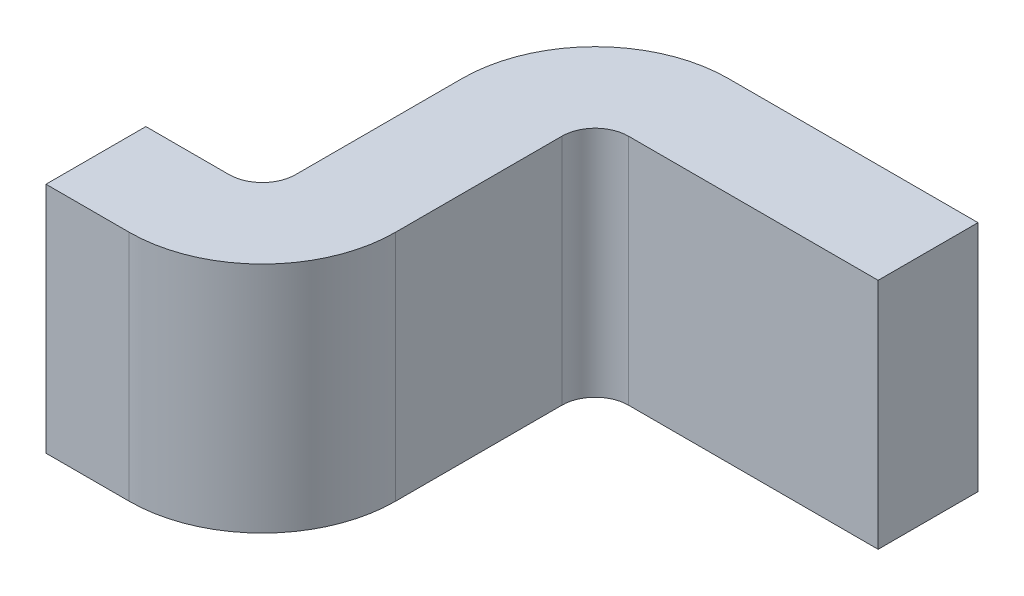
ISO-10303-21;
HEADER;
FILE_DESCRIPTION(('STEP AP214'),'2;1');
FILE_NAME('part.step','',(''),(''),'','','');
FILE_SCHEMA(('AUTOMOTIVE_DESIGN { 1 0 10303 214 1 1 1 1 }'));
ENDSEC;
DATA;
#1=APPLICATION_CONTEXT('core data for automotive mechanical design processes');
#2=APPLICATION_PROTOCOL_DEFINITION('international standard','automotive_design',2000,#1);
#3=PRODUCT_CONTEXT('',#1,'mechanical');
#4=PRODUCT('Part','Part','',(#3));
#5=PRODUCT_RELATED_PRODUCT_CATEGORY('part','',(#4));
#6=PRODUCT_DEFINITION_FORMATION('','',#4);
#7=PRODUCT_DEFINITION_CONTEXT('part definition',#1,'design');
#8=PRODUCT_DEFINITION('design','',#6,#7);
#9=PRODUCT_DEFINITION_SHAPE('','',#8);
#10=(LENGTH_UNIT() NAMED_UNIT(*) SI_UNIT(.MILLI.,.METRE.));
#11=(NAMED_UNIT(*) PLANE_ANGLE_UNIT() SI_UNIT($,.RADIAN.));
#12=(NAMED_UNIT(*) SI_UNIT($,.STERADIAN.) SOLID_ANGLE_UNIT());
#13=UNCERTAINTY_MEASURE_WITH_UNIT(LENGTH_MEASURE(1.E-05),#10,'distance_accuracy_value','');
#14=(GEOMETRIC_REPRESENTATION_CONTEXT(3) GLOBAL_UNCERTAINTY_ASSIGNED_CONTEXT((#13)) GLOBAL_UNIT_ASSIGNED_CONTEXT((#10,
#11,#12)) REPRESENTATION_CONTEXT('',''));
#15=CARTESIAN_POINT('',(0.,0.,0.));
#16=DIRECTION('',(0.,0.,1.));
#17=DIRECTION('',(1.,0.,0.));
#18=AXIS2_PLACEMENT_3D('',#15,#16,#17);
#19=CARTESIAN_POINT('',(4.075,2.5917811708335,0.));
#20=DIRECTION('',(0.,1.,0.));
#21=DIRECTION('',(-1.,0.,0.));
#22=AXIS2_PLACEMENT_3D('',#19,#20,#21);
#23=PLANE('',#22);
#24=DIRECTION('',(-1.,0.,0.));
#25=VECTOR('',#24,1.);
#26=CARTESIAN_POINT('',(0.,2.5917811708335,0.));
#27=LINE('',#26,#25);
#28=CARTESIAN_POINT('',(3.75,2.5917811708335,0.));
#29=VERTEX_POINT('',#28);
#30=CARTESIAN_POINT('',(4.5,2.5917811708335,0.));
#31=VERTEX_POINT('',#30);
#32=EDGE_CURVE('E134',#29,#31,#27,.F.);
#33=ORIENTED_EDGE('',*,*,#32,.F.);
#34=CARTESIAN_POINT('',(3.75,2.5917811708335,0.4));
#35=DIRECTION('',(0.,-1.,0.));
#36=DIRECTION('',(1.,0.,0.));
#37=AXIS2_PLACEMENT_3D('',#34,#35,#36);
#38=CIRCLE('',#37,0.4);
#39=CARTESIAN_POINT('',(3.35,2.5917811708335,0.4));
#40=VERTEX_POINT('',#39);
#41=EDGE_CURVE('E182',#40,#29,#38,.T.);
#42=ORIENTED_EDGE('',*,*,#41,.F.);
#43=DIRECTION('',(0.,0.,1.));
#44=VECTOR('',#43,1.);
#45=CARTESIAN_POINT('',(3.35,2.5917811708335,0.));
#46=LINE('',#45,#44);
#47=CARTESIAN_POINT('',(3.35,2.5917811708335,0.9));
#48=VERTEX_POINT('',#47);
#49=EDGE_CURVE('E140',#48,#40,#46,.F.);
#50=ORIENTED_EDGE('',*,*,#49,.F.);
#51=CARTESIAN_POINT('',(3.25,2.5917811708335,0.9));
#52=DIRECTION('',(0.,1.,0.));
#53=DIRECTION('',(-1.,0.,0.));
#54=AXIS2_PLACEMENT_3D('',#51,#52,#53);
#55=CIRCLE('',#54,0.1);
#56=CARTESIAN_POINT('',(3.25,2.5917811708335,1.));
#57=VERTEX_POINT('',#56);
#58=EDGE_CURVE('E185',#48,#57,#55,.F.);
#59=ORIENTED_EDGE('',*,*,#58,.T.);
#60=DIRECTION('',(1.,0.,0.));
#61=VECTOR('',#60,1.);
#62=CARTESIAN_POINT('',(3.5,2.5917811708335,1.));
#63=LINE('',#62,#61);
#64=CARTESIAN_POINT('',(3.,2.5917811708335,1.));
#65=VERTEX_POINT('',#64);
#66=EDGE_CURVE('E144',#57,#65,#63,.F.);
#67=ORIENTED_EDGE('',*,*,#66,.T.);
#68=DIRECTION('',(0.,0.,1.));
#69=VECTOR('',#68,1.);
#70=CARTESIAN_POINT('',(3.,2.5917811708335,1.));
#71=LINE('',#70,#69);
#72=CARTESIAN_POINT('',(3.,2.5917811708335,1.3));
#73=VERTEX_POINT('',#72);
#74=EDGE_CURVE('E148',#73,#65,#71,.F.);
#75=ORIENTED_EDGE('',*,*,#74,.F.);
#76=DIRECTION('',(1.,0.,0.));
#77=VECTOR('',#76,1.);
#78=CARTESIAN_POINT('',(3.65,2.5917811708335,1.3));
#79=LINE('',#78,#77);
#80=CARTESIAN_POINT('',(3.25,2.5917811708335,1.3));
#81=VERTEX_POINT('',#80);
#82=EDGE_CURVE('E156',#81,#73,#79,.F.);
#83=ORIENTED_EDGE('',*,*,#82,.F.);
#84=CARTESIAN_POINT('',(3.25,2.5917811708335,0.9));
#85=DIRECTION('',(0.,-1.,0.));
#86=DIRECTION('',(1.,0.,0.));
#87=AXIS2_PLACEMENT_3D('',#84,#85,#86);
#88=CIRCLE('',#87,0.4);
#89=CARTESIAN_POINT('',(3.65,2.5917811708335,0.9));
#90=VERTEX_POINT('',#89);
#91=EDGE_CURVE('E187',#90,#81,#88,.T.);
#92=ORIENTED_EDGE('',*,*,#91,.F.);
#93=DIRECTION('',(0.,0.,1.));
#94=VECTOR('',#93,1.);
#95=CARTESIAN_POINT('',(3.65,2.5917811708335,0.15));
#96=LINE('',#95,#94);
#97=CARTESIAN_POINT('',(3.65,2.5917811708335,0.4));
#98=VERTEX_POINT('',#97);
#99=EDGE_CURVE('E162',#90,#98,#96,.F.);
#100=ORIENTED_EDGE('',*,*,#99,.T.);
#101=CARTESIAN_POINT('',(3.75,2.5917811708335,0.4));
#102=DIRECTION('',(0.,-1.,0.));
#103=DIRECTION('',(1.,0.,0.));
#104=AXIS2_PLACEMENT_3D('',#101,#102,#103);
#105=CIRCLE('',#104,0.1);
#106=CARTESIAN_POINT('',(3.75,2.5917811708335,0.3));
#107=VERTEX_POINT('',#106);
#108=EDGE_CURVE('E20',#98,#107,#105,.T.);
#109=ORIENTED_EDGE('',*,*,#108,.T.);
#110=DIRECTION('',(-1.,0.,0.));
#111=VECTOR('',#110,1.);
#112=CARTESIAN_POINT('',(0.,2.5917811708335,0.3));
#113=LINE('',#112,#111);
#114=CARTESIAN_POINT('',(4.5,2.5917811708335,0.3));
#115=VERTEX_POINT('',#114);
#116=EDGE_CURVE('E92',#107,#115,#113,.F.);
#117=ORIENTED_EDGE('',*,*,#116,.T.);
#118=DIRECTION('',(0.,0.,1.));
#119=VECTOR('',#118,1.);
#120=CARTESIAN_POINT('',(4.5,2.5917811708335,0.));
#121=LINE('',#120,#119);
#122=EDGE_CURVE('E112',#31,#115,#121,.T.);
#123=ORIENTED_EDGE('',*,*,#122,.F.);
#124=EDGE_LOOP('',(#33,#42,#50,#59,#67,#75,#83,#92,#100,#109,#117,#123));
#125=FACE_BOUND('',#124,.T.);
#126=ADVANCED_FACE('F17',(#125),#23,.T.);
#127=CARTESIAN_POINT('',(0.,4.48356234166701,0.));
#128=DIRECTION('',(0.,0.,-1.));
#129=DIRECTION('',(-1.,0.,0.));
#130=AXIS2_PLACEMENT_3D('',#127,#128,#129);
#131=PLANE('',#130);
#132=DIRECTION('',(0.,1.,0.));
#133=VECTOR('',#132,1.);
#134=CARTESIAN_POINT('',(4.5,2.2417811708335,0.));
#135=LINE('',#134,#133);
#136=CARTESIAN_POINT('',(4.5,1.8917811708335,0.));
#137=VERTEX_POINT('',#136);
#138=EDGE_CURVE('E101',#137,#31,#135,.T.);
#139=ORIENTED_EDGE('',*,*,#138,.F.);
#140=DIRECTION('',(1.,0.,0.));
#141=VECTOR('',#140,1.);
#142=CARTESIAN_POINT('',(4.075,1.8917811708335,0.));
#143=LINE('',#142,#141);
#144=CARTESIAN_POINT('',(3.75,1.8917811708335,0.));
#145=VERTEX_POINT('',#144);
#146=EDGE_CURVE('E125',#145,#137,#143,.T.);
#147=ORIENTED_EDGE('',*,*,#146,.F.);
#148=DIRECTION('',(0.,1.,0.));
#149=VECTOR('',#148,1.);
#150=CARTESIAN_POINT('',(3.75,4.48356234166701,0.));
#151=LINE('',#150,#149);
#152=EDGE_CURVE('E137',#145,#29,#151,.T.);
#153=ORIENTED_EDGE('',*,*,#152,.T.);
#154=ORIENTED_EDGE('',*,*,#32,.T.);
#155=EDGE_LOOP('',(#139,#147,#153,#154));
#156=FACE_BOUND('',#155,.T.);
#157=ADVANCED_FACE('F381',(#156),#131,.T.);
#158=CARTESIAN_POINT('',(4.5,2.2417811708335,0.));
#159=DIRECTION('',(1.,0.,0.));
#160=DIRECTION('',(0.,1.,0.));
#161=AXIS2_PLACEMENT_3D('',#158,#159,#160);
#162=PLANE('',#161);
#163=ORIENTED_EDGE('',*,*,#138,.T.);
#164=ORIENTED_EDGE('',*,*,#122,.T.);
#165=DIRECTION('',(0.,1.,0.));
#166=VECTOR('',#165,1.);
#167=CARTESIAN_POINT('',(4.5,4.48356234166701,0.3));
#168=LINE('',#167,#166);
#169=CARTESIAN_POINT('',(4.5,1.8917811708335,0.3));
#170=VERTEX_POINT('',#169);
#171=EDGE_CURVE('E106',#115,#170,#168,.F.);
#172=ORIENTED_EDGE('',*,*,#171,.T.);
#173=DIRECTION('',(0.,0.,1.));
#174=VECTOR('',#173,1.);
#175=CARTESIAN_POINT('',(4.5,1.8917811708335,0.));
#176=LINE('',#175,#174);
#177=EDGE_CURVE('E110',#137,#170,#176,.T.);
#178=ORIENTED_EDGE('',*,*,#177,.F.);
#179=EDGE_LOOP('',(#163,#164,#172,#178));
#180=FACE_BOUND('',#179,.T.);
#181=ADVANCED_FACE('F108',(#180),#162,.T.);
#182=CARTESIAN_POINT('',(0.,4.48356234166701,0.3));
#183=DIRECTION('',(0.,0.,-1.));
#184=DIRECTION('',(-1.,0.,0.));
#185=AXIS2_PLACEMENT_3D('',#182,#183,#184);
#186=PLANE('',#185);
#187=DIRECTION('',(1.,0.,0.));
#188=VECTOR('',#187,1.);
#189=CARTESIAN_POINT('',(4.075,1.8917811708335,0.3));
#190=LINE('',#189,#188);
#191=CARTESIAN_POINT('',(3.75,1.8917811708335,0.3));
#192=VERTEX_POINT('',#191);
#193=EDGE_CURVE('E117',#170,#192,#190,.F.);
#194=ORIENTED_EDGE('',*,*,#193,.F.);
#195=ORIENTED_EDGE('',*,*,#171,.F.);
#196=ORIENTED_EDGE('',*,*,#116,.F.);
#197=DIRECTION('',(0.,-1.,0.));
#198=VECTOR('',#197,1.);
#199=CARTESIAN_POINT('',(3.75,3.36267175625025,0.3));
#200=LINE('',#199,#198);
#201=EDGE_CURVE('E114',#107,#192,#200,.T.);
#202=ORIENTED_EDGE('',*,*,#201,.T.);
#203=EDGE_LOOP('',(#194,#195,#196,#202));
#204=FACE_BOUND('',#203,.T.);
#205=ADVANCED_FACE('F118',(#204),#186,.F.);
#206=CARTESIAN_POINT('',(3.75,3.36267175625025,0.4));
#207=DIRECTION('',(0.,-1.,0.));
#208=DIRECTION('',(1.,0.,0.));
#209=AXIS2_PLACEMENT_3D('',#206,#207,#208);
#210=CYLINDRICAL_SURFACE('',#209,0.1);
#211=ORIENTED_EDGE('',*,*,#108,.F.);
#212=DIRECTION('',(0.,-1.,0.));
#213=VECTOR('',#212,1.);
#214=CARTESIAN_POINT('',(3.65,2.2417811708335,0.4));
#215=LINE('',#214,#213);
#216=CARTESIAN_POINT('',(3.65,1.8917811708335,0.4));
#217=VERTEX_POINT('',#216);
#218=EDGE_CURVE('E164',#98,#217,#215,.T.);
#219=ORIENTED_EDGE('',*,*,#218,.T.);
#220=CARTESIAN_POINT('',(3.75,1.8917811708335,0.4));
#221=DIRECTION('',(0.,-1.,0.));
#222=DIRECTION('',(1.,0.,0.));
#223=AXIS2_PLACEMENT_3D('',#220,#221,#222);
#224=CIRCLE('',#223,0.1);
#225=EDGE_CURVE('E122',#192,#217,#224,.F.);
#226=ORIENTED_EDGE('',*,*,#225,.F.);
#227=ORIENTED_EDGE('',*,*,#201,.F.);
#228=EDGE_LOOP('',(#211,#219,#226,#227));
#229=FACE_BOUND('',#228,.T.);
#230=ADVANCED_FACE('F262',(#229),#210,.F.);
#231=CARTESIAN_POINT('',(3.65,2.2417811708335,0.15));
#232=DIRECTION('',(-1.,0.,0.));
#233=DIRECTION('',(0.,-1.,0.));
#234=AXIS2_PLACEMENT_3D('',#231,#232,#233);
#235=PLANE('',#234);
#236=ORIENTED_EDGE('',*,*,#99,.F.);
#237=DIRECTION('',(0.,-1.,0.));
#238=VECTOR('',#237,1.);
#239=CARTESIAN_POINT('',(3.65,2.2417811708335,0.9));
#240=LINE('',#239,#238);
#241=CARTESIAN_POINT('',(3.65,1.8917811708335,0.9));
#242=VERTEX_POINT('',#241);
#243=EDGE_CURVE('E188',#242,#90,#240,.F.);
#244=ORIENTED_EDGE('',*,*,#243,.F.);
#245=DIRECTION('',(0.,0.,1.));
#246=VECTOR('',#245,1.);
#247=CARTESIAN_POINT('',(3.65,1.8917811708335,0.));
#248=LINE('',#247,#246);
#249=EDGE_CURVE('E179',#217,#242,#248,.T.);
#250=ORIENTED_EDGE('',*,*,#249,.F.);
#251=ORIENTED_EDGE('',*,*,#218,.F.);
#252=EDGE_LOOP('',(#236,#244,#250,#251));
#253=FACE_BOUND('',#252,.T.);
#254=ADVANCED_FACE('F254',(#253),#235,.F.);
#255=CARTESIAN_POINT('',(3.25,2.2417811708335,0.9));
#256=DIRECTION('',(0.,-1.,0.));
#257=DIRECTION('',(1.,0.,0.));
#258=AXIS2_PLACEMENT_3D('',#255,#256,#257);
#259=CYLINDRICAL_SURFACE('',#258,0.4);
#260=DIRECTION('',(0.,1.,0.));
#261=VECTOR('',#260,1.);
#262=CARTESIAN_POINT('',(3.25,2.2417811708335,1.3));
#263=LINE('',#262,#261);
#264=CARTESIAN_POINT('',(3.25,1.8917811708335,1.3));
#265=VERTEX_POINT('',#264);
#266=EDGE_CURVE('E159',#265,#81,#263,.T.);
#267=ORIENTED_EDGE('',*,*,#266,.F.);
#268=CARTESIAN_POINT('',(3.25,1.8917811708335,0.9));
#269=DIRECTION('',(0.,-1.,0.));
#270=DIRECTION('',(1.,0.,0.));
#271=AXIS2_PLACEMENT_3D('',#268,#269,#270);
#272=CIRCLE('',#271,0.4);
#273=EDGE_CURVE('E176',#242,#265,#272,.T.);
#274=ORIENTED_EDGE('',*,*,#273,.F.);
#275=ORIENTED_EDGE('',*,*,#243,.T.);
#276=ORIENTED_EDGE('',*,*,#91,.T.);
#277=EDGE_LOOP('',(#267,#274,#275,#276));
#278=FACE_BOUND('',#277,.T.);
#279=ADVANCED_FACE('F252',(#278),#259,.T.);
#280=CARTESIAN_POINT('',(3.65,2.2417811708335,1.3));
#281=DIRECTION('',(0.,0.,1.));
#282=DIRECTION('',(1.,0.,0.));
#283=AXIS2_PLACEMENT_3D('',#280,#281,#282);
#284=PLANE('',#283);
#285=DIRECTION('',(0.,-1.,0.));
#286=VECTOR('',#285,1.);
#287=CARTESIAN_POINT('',(3.,2.2417811708335,1.3));
#288=LINE('',#287,#286);
#289=CARTESIAN_POINT('',(3.,1.8917811708335,1.3));
#290=VERTEX_POINT('',#289);
#291=EDGE_CURVE('E153',#290,#73,#288,.F.);
#292=ORIENTED_EDGE('',*,*,#291,.F.);
#293=DIRECTION('',(1.,0.,0.));
#294=VECTOR('',#293,1.);
#295=CARTESIAN_POINT('',(4.075,1.8917811708335,1.3));
#296=LINE('',#295,#294);
#297=EDGE_CURVE('E178',#265,#290,#296,.F.);
#298=ORIENTED_EDGE('',*,*,#297,.F.);
#299=ORIENTED_EDGE('',*,*,#266,.T.);
#300=ORIENTED_EDGE('',*,*,#82,.T.);
#301=EDGE_LOOP('',(#292,#298,#299,#300));
#302=FACE_BOUND('',#301,.T.);
#303=ADVANCED_FACE('F247',(#302),#284,.T.);
#304=CARTESIAN_POINT('',(3.,2.2417811708335,1.));
#305=DIRECTION('',(-1.,0.,0.));
#306=DIRECTION('',(0.,-1.,0.));
#307=AXIS2_PLACEMENT_3D('',#304,#305,#306);
#308=PLANE('',#307);
#309=DIRECTION('',(0.,1.,0.));
#310=VECTOR('',#309,1.);
#311=CARTESIAN_POINT('',(3.,2.2417811708335,1.));
#312=LINE('',#311,#310);
#313=CARTESIAN_POINT('',(3.,1.8917811708335,1.));
#314=VERTEX_POINT('',#313);
#315=EDGE_CURVE('E147',#65,#314,#312,.F.);
#316=ORIENTED_EDGE('',*,*,#315,.T.);
#317=DIRECTION('',(0.,0.,1.));
#318=VECTOR('',#317,1.);
#319=CARTESIAN_POINT('',(3.,1.8917811708335,0.));
#320=LINE('',#319,#318);
#321=EDGE_CURVE('E207',#290,#314,#320,.F.);
#322=ORIENTED_EDGE('',*,*,#321,.F.);
#323=ORIENTED_EDGE('',*,*,#291,.T.);
#324=ORIENTED_EDGE('',*,*,#74,.T.);
#325=EDGE_LOOP('',(#316,#322,#323,#324));
#326=FACE_BOUND('',#325,.T.);
#327=ADVANCED_FACE('F250',(#326),#308,.T.);
#328=CARTESIAN_POINT('',(3.5,2.2417811708335,1.));
#329=DIRECTION('',(0.,0.,1.));
#330=DIRECTION('',(1.,0.,0.));
#331=AXIS2_PLACEMENT_3D('',#328,#329,#330);
#332=PLANE('',#331);
#333=DIRECTION('',(1.,0.,0.));
#334=VECTOR('',#333,1.);
#335=CARTESIAN_POINT('',(4.075,1.8917811708335,1.));
#336=LINE('',#335,#334);
#337=CARTESIAN_POINT('',(3.25,1.8917811708335,1.));
#338=VERTEX_POINT('',#337);
#339=EDGE_CURVE('E175',#314,#338,#336,.T.);
#340=ORIENTED_EDGE('',*,*,#339,.F.);
#341=ORIENTED_EDGE('',*,*,#315,.F.);
#342=ORIENTED_EDGE('',*,*,#66,.F.);
#343=DIRECTION('',(0.,1.,0.));
#344=VECTOR('',#343,1.);
#345=CARTESIAN_POINT('',(3.25,2.2417811708335,1.));
#346=LINE('',#345,#344);
#347=EDGE_CURVE('E186',#57,#338,#346,.F.);
#348=ORIENTED_EDGE('',*,*,#347,.T.);
#349=EDGE_LOOP('',(#340,#341,#342,#348));
#350=FACE_BOUND('',#349,.T.);
#351=ADVANCED_FACE('F237',(#350),#332,.F.);
#352=CARTESIAN_POINT('',(3.25,2.2417811708335,0.9));
#353=DIRECTION('',(0.,1.,0.));
#354=DIRECTION('',(-1.,0.,0.));
#355=AXIS2_PLACEMENT_3D('',#352,#353,#354);
#356=CYLINDRICAL_SURFACE('',#355,0.1);
#357=ORIENTED_EDGE('',*,*,#58,.F.);
#358=DIRECTION('',(0.,-1.,0.));
#359=VECTOR('',#358,1.);
#360=CARTESIAN_POINT('',(3.35,2.2417811708335,0.9));
#361=LINE('',#360,#359);
#362=CARTESIAN_POINT('',(3.35,1.8917811708335,0.9));
#363=VERTEX_POINT('',#362);
#364=EDGE_CURVE('E143',#363,#48,#361,.F.);
#365=ORIENTED_EDGE('',*,*,#364,.F.);
#366=CARTESIAN_POINT('',(3.25,1.8917811708335,0.9));
#367=DIRECTION('',(0.,1.,0.));
#368=DIRECTION('',(-1.,0.,0.));
#369=AXIS2_PLACEMENT_3D('',#366,#367,#368);
#370=CIRCLE('',#369,0.1);
#371=EDGE_CURVE('E26',#338,#363,#370,.T.);
#372=ORIENTED_EDGE('',*,*,#371,.F.);
#373=ORIENTED_EDGE('',*,*,#347,.F.);
#374=EDGE_LOOP('',(#357,#365,#372,#373));
#375=FACE_BOUND('',#374,.T.);
#376=ADVANCED_FACE('F276',(#375),#356,.F.);
#377=CARTESIAN_POINT('',(3.35,2.2417811708335,0.));
#378=DIRECTION('',(-1.,0.,0.));
#379=DIRECTION('',(0.,-1.,0.));
#380=AXIS2_PLACEMENT_3D('',#377,#378,#379);
#381=PLANE('',#380);
#382=ORIENTED_EDGE('',*,*,#364,.T.);
#383=ORIENTED_EDGE('',*,*,#49,.T.);
#384=DIRECTION('',(0.,-1.,0.));
#385=VECTOR('',#384,1.);
#386=CARTESIAN_POINT('',(3.35,3.36267175625025,0.4));
#387=LINE('',#386,#385);
#388=CARTESIAN_POINT('',(3.35,1.8917811708335,0.4));
#389=VERTEX_POINT('',#388);
#390=EDGE_CURVE('E142',#389,#40,#387,.F.);
#391=ORIENTED_EDGE('',*,*,#390,.F.);
#392=DIRECTION('',(0.,0.,1.));
#393=VECTOR('',#392,1.);
#394=CARTESIAN_POINT('',(3.35,1.8917811708335,0.));
#395=LINE('',#394,#393);
#396=EDGE_CURVE('E11',#363,#389,#395,.F.);
#397=ORIENTED_EDGE('',*,*,#396,.F.);
#398=EDGE_LOOP('',(#382,#383,#391,#397));
#399=FACE_BOUND('',#398,.T.);
#400=ADVANCED_FACE('F271',(#399),#381,.T.);
#401=CARTESIAN_POINT('',(3.75,3.36267175625025,0.4));
#402=DIRECTION('',(0.,-1.,0.));
#403=DIRECTION('',(1.,0.,0.));
#404=AXIS2_PLACEMENT_3D('',#401,#402,#403);
#405=CYLINDRICAL_SURFACE('',#404,0.4);
#406=ORIENTED_EDGE('',*,*,#390,.T.);
#407=ORIENTED_EDGE('',*,*,#41,.T.);
#408=ORIENTED_EDGE('',*,*,#152,.F.);
#409=CARTESIAN_POINT('',(3.75,1.8917811708335,0.4));
#410=DIRECTION('',(0.,-1.,0.));
#411=DIRECTION('',(1.,0.,0.));
#412=AXIS2_PLACEMENT_3D('',#409,#410,#411);
#413=CIRCLE('',#412,0.4);
#414=EDGE_CURVE('E35',#389,#145,#413,.T.);
#415=ORIENTED_EDGE('',*,*,#414,.F.);
#416=EDGE_LOOP('',(#406,#407,#408,#415));
#417=FACE_BOUND('',#416,.T.);
#418=ADVANCED_FACE('F266',(#417),#405,.T.);
#419=CARTESIAN_POINT('',(4.075,1.8917811708335,0.));
#420=DIRECTION('',(0.,-1.,0.));
#421=DIRECTION('',(1.,0.,0.));
#422=AXIS2_PLACEMENT_3D('',#419,#420,#421);
#423=PLANE('',#422);
#424=ORIENTED_EDGE('',*,*,#396,.T.);
#425=ORIENTED_EDGE('',*,*,#414,.T.);
#426=ORIENTED_EDGE('',*,*,#146,.T.);
#427=ORIENTED_EDGE('',*,*,#177,.T.);
#428=ORIENTED_EDGE('',*,*,#193,.T.);
#429=ORIENTED_EDGE('',*,*,#225,.T.);
#430=ORIENTED_EDGE('',*,*,#249,.T.);
#431=ORIENTED_EDGE('',*,*,#273,.T.);
#432=ORIENTED_EDGE('',*,*,#297,.T.);
#433=ORIENTED_EDGE('',*,*,#321,.T.);
#434=ORIENTED_EDGE('',*,*,#339,.T.);
#435=ORIENTED_EDGE('',*,*,#371,.T.);
#436=EDGE_LOOP('',(#424,#425,#426,#427,#428,#429,#430,#431,#432,#433,#434,#435));
#437=FACE_BOUND('',#436,.T.);
#438=ADVANCED_FACE('F124',(#437),#423,.T.);
#439=CLOSED_SHELL('',(#126,#157,#181,#205,#230,#254,#279,#303,#327,#351,#376,#400,#418,#438));
#440=MANIFOLD_SOLID_BREP('B1',#439);
#441=ADVANCED_BREP_SHAPE_REPRESENTATION('',(#18,#440),#14);
#442=SHAPE_DEFINITION_REPRESENTATION(#9,#441);
ENDSEC;
END-ISO-10303-21;
